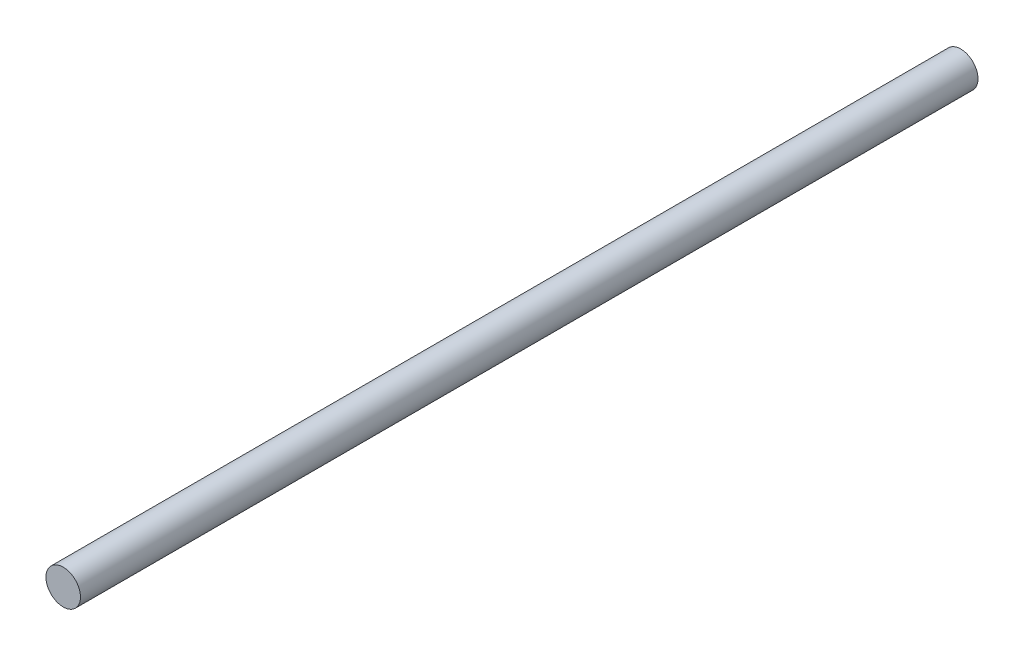
ISO-10303-21;
HEADER;
FILE_DESCRIPTION(('STEP AP214'),'2;1');
FILE_NAME('part.step','',(''),(''),'','','');
FILE_SCHEMA(('AUTOMOTIVE_DESIGN { 1 0 10303 214 1 1 1 1 }'));
ENDSEC;
DATA;
#1=APPLICATION_CONTEXT('core data for automotive mechanical design processes');
#2=APPLICATION_PROTOCOL_DEFINITION('international standard','automotive_design',2000,#1);
#3=PRODUCT_CONTEXT('',#1,'mechanical');
#4=PRODUCT('Part','Part','',(#3));
#5=PRODUCT_RELATED_PRODUCT_CATEGORY('part','',(#4));
#6=PRODUCT_DEFINITION_FORMATION('','',#4);
#7=PRODUCT_DEFINITION_CONTEXT('part definition',#1,'design');
#8=PRODUCT_DEFINITION('design','',#6,#7);
#9=PRODUCT_DEFINITION_SHAPE('','',#8);
#10=(LENGTH_UNIT() NAMED_UNIT(*) SI_UNIT(.MILLI.,.METRE.));
#11=(NAMED_UNIT(*) PLANE_ANGLE_UNIT() SI_UNIT($,.RADIAN.));
#12=(NAMED_UNIT(*) SI_UNIT($,.STERADIAN.) SOLID_ANGLE_UNIT());
#13=UNCERTAINTY_MEASURE_WITH_UNIT(LENGTH_MEASURE(1.E-05),#10,'distance_accuracy_value','');
#14=(GEOMETRIC_REPRESENTATION_CONTEXT(3) GLOBAL_UNCERTAINTY_ASSIGNED_CONTEXT((#13)) GLOBAL_UNIT_ASSIGNED_CONTEXT((#10,
#11,#12)) REPRESENTATION_CONTEXT('',''));
#15=CARTESIAN_POINT('',(0.,0.,0.));
#16=DIRECTION('',(0.,0.,1.));
#17=DIRECTION('',(1.,0.,0.));
#18=AXIS2_PLACEMENT_3D('',#15,#16,#17);
#19=CARTESIAN_POINT('',(0.,0.,-130.));
#20=DIRECTION('',(0.,0.,1.));
#21=DIRECTION('',(1.,0.,0.));
#22=AXIS2_PLACEMENT_3D('',#19,#20,#21);
#23=CYLINDRICAL_SURFACE('',#22,5.);
#24=CARTESIAN_POINT('',(0.,0.,-130.));
#25=DIRECTION('',(0.,0.,1.));
#26=DIRECTION('',(1.,0.,0.));
#27=AXIS2_PLACEMENT_3D('',#24,#25,#26);
#28=CIRCLE('',#27,5.);
#29=CARTESIAN_POINT('',(5.,0.,-130.));
#30=VERTEX_POINT('',#29);
#31=EDGE_CURVE('E10',#30,#30,#28,.T.);
#32=ORIENTED_EDGE('',*,*,#31,.T.);
#33=EDGE_LOOP('',(#32));
#34=FACE_BOUND('',#33,.T.);
#35=CARTESIAN_POINT('',(0.,0.,130.));
#36=DIRECTION('',(0.,0.,1.));
#37=DIRECTION('',(1.,0.,0.));
#38=AXIS2_PLACEMENT_3D('',#35,#36,#37);
#39=CIRCLE('',#38,5.);
#40=CARTESIAN_POINT('',(5.,0.,130.));
#41=VERTEX_POINT('',#40);
#42=EDGE_CURVE('E36',#41,#41,#39,.T.);
#43=ORIENTED_EDGE('',*,*,#42,.F.);
#44=EDGE_LOOP('',(#43));
#45=FACE_BOUND('',#44,.T.);
#46=ADVANCED_FACE('F30',(#34,#45),#23,.T.);
#47=CARTESIAN_POINT('',(0.,0.,-130.));
#48=DIRECTION('',(0.,0.,1.));
#49=DIRECTION('',(1.,0.,0.));
#50=AXIS2_PLACEMENT_3D('',#47,#48,#49);
#51=PLANE('',#50);
#52=ORIENTED_EDGE('',*,*,#31,.F.);
#53=EDGE_LOOP('',(#52));
#54=FACE_BOUND('',#53,.T.);
#55=ADVANCED_FACE('F45',(#54),#51,.F.);
#56=CARTESIAN_POINT('',(0.,0.,130.));
#57=DIRECTION('',(0.,0.,1.));
#58=DIRECTION('',(1.,0.,0.));
#59=AXIS2_PLACEMENT_3D('',#56,#57,#58);
#60=PLANE('',#59);
#61=ORIENTED_EDGE('',*,*,#42,.T.);
#62=EDGE_LOOP('',(#61));
#63=FACE_BOUND('',#62,.T.);
#64=ADVANCED_FACE('F42',(#63),#60,.T.);
#65=CLOSED_SHELL('',(#46,#55,#64));
#66=MANIFOLD_SOLID_BREP('B2',#65);
#67=ADVANCED_BREP_SHAPE_REPRESENTATION('',(#18,#66),#14);
#68=SHAPE_DEFINITION_REPRESENTATION(#9,#67);
ENDSEC;
END-ISO-10303-21;
